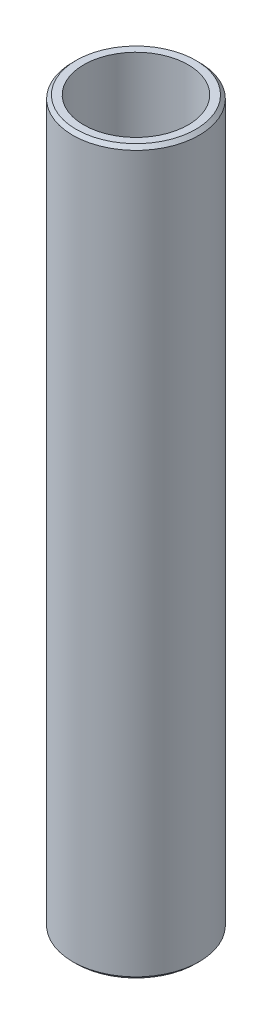
ISO-10303-21;
HEADER;
FILE_DESCRIPTION(('STEP AP214'),'2;1');
FILE_NAME('part.step','',(''),(''),'','','');
FILE_SCHEMA(('AUTOMOTIVE_DESIGN { 1 0 10303 214 1 1 1 1 }'));
ENDSEC;
DATA;
#1=APPLICATION_CONTEXT('core data for automotive mechanical design processes');
#2=APPLICATION_PROTOCOL_DEFINITION('international standard','automotive_design',2000,#1);
#3=PRODUCT_CONTEXT('',#1,'mechanical');
#4=PRODUCT('Part','Part','',(#3));
#5=PRODUCT_RELATED_PRODUCT_CATEGORY('part','',(#4));
#6=PRODUCT_DEFINITION_FORMATION('','',#4);
#7=PRODUCT_DEFINITION_CONTEXT('part definition',#1,'design');
#8=PRODUCT_DEFINITION('design','',#6,#7);
#9=PRODUCT_DEFINITION_SHAPE('','',#8);
#10=(LENGTH_UNIT() NAMED_UNIT(*) SI_UNIT(.MILLI.,.METRE.));
#11=(NAMED_UNIT(*) PLANE_ANGLE_UNIT() SI_UNIT($,.RADIAN.));
#12=(NAMED_UNIT(*) SI_UNIT($,.STERADIAN.) SOLID_ANGLE_UNIT());
#13=UNCERTAINTY_MEASURE_WITH_UNIT(LENGTH_MEASURE(1.E-05),#10,'distance_accuracy_value','');
#14=(GEOMETRIC_REPRESENTATION_CONTEXT(3) GLOBAL_UNCERTAINTY_ASSIGNED_CONTEXT((#13)) GLOBAL_UNIT_ASSIGNED_CONTEXT((#10,
#11,#12)) REPRESENTATION_CONTEXT('',''));
#15=CARTESIAN_POINT('',(0.,0.,0.));
#16=DIRECTION('',(0.,0.,1.));
#17=DIRECTION('',(1.,0.,0.));
#18=AXIS2_PLACEMENT_3D('',#15,#16,#17);
#19=CARTESIAN_POINT('',(0.,600.,0.));
#20=DIRECTION('',(0.,-1.,0.));
#21=DIRECTION('',(0.,0.,-1.));
#22=AXIS2_PLACEMENT_3D('',#19,#20,#21);
#23=CYLINDRICAL_SURFACE('',#22,52.5);
#24=CARTESIAN_POINT('',(0.,597.164512716572,0.));
#25=DIRECTION('',(0.,1.,0.));
#26=DIRECTION('',(0.,0.,1.));
#27=AXIS2_PLACEMENT_3D('',#24,#25,#26);
#28=CIRCLE('',#27,52.5);
#29=CARTESIAN_POINT('',(0.,597.164512716572,52.5));
#30=VERTEX_POINT('',#29);
#31=EDGE_CURVE('E50',#30,#30,#28,.F.);
#32=ORIENTED_EDGE('',*,*,#31,.T.);
#33=EDGE_LOOP('',(#32));
#34=FACE_BOUND('',#33,.T.);
#35=CARTESIAN_POINT('',(0.,2.83548728342797,0.));
#36=DIRECTION('',(0.,1.,0.));
#37=DIRECTION('',(0.,0.,1.));
#38=AXIS2_PLACEMENT_3D('',#35,#36,#37);
#39=CIRCLE('',#38,52.5);
#40=CARTESIAN_POINT('',(0.,2.83548728342797,52.5));
#41=VERTEX_POINT('',#40);
#42=EDGE_CURVE('E51',#41,#41,#39,.T.);
#43=ORIENTED_EDGE('',*,*,#42,.T.);
#44=EDGE_LOOP('',(#43));
#45=FACE_BOUND('',#44,.T.);
#46=ADVANCED_FACE('F39',(#34,#45),#23,.T.);
#47=CARTESIAN_POINT('',(0.,600.,0.));
#48=DIRECTION('',(0.,1.,0.));
#49=DIRECTION('',(0.,0.,1.));
#50=AXIS2_PLACEMENT_3D('',#47,#48,#49);
#51=PLANE('',#50);
#52=CARTESIAN_POINT('',(0.,600.,0.));
#53=DIRECTION('',(0.,1.,0.));
#54=DIRECTION('',(0.,0.,1.));
#55=AXIS2_PLACEMENT_3D('',#52,#53,#54);
#56=CIRCLE('',#55,49.6645127165719);
#57=CARTESIAN_POINT('',(0.,600.,49.6645127165719));
#58=VERTEX_POINT('',#57);
#59=EDGE_CURVE('E54',#58,#58,#56,.T.);
#60=ORIENTED_EDGE('',*,*,#59,.T.);
#61=EDGE_LOOP('',(#60));
#62=FACE_BOUND('',#61,.T.);
#63=CARTESIAN_POINT('',(0.,600.,0.));
#64=DIRECTION('',(0.,1.,0.));
#65=DIRECTION('',(0.,0.,1.));
#66=AXIS2_PLACEMENT_3D('',#63,#64,#65);
#67=CIRCLE('',#66,43.3384236775252);
#68=CARTESIAN_POINT('',(0.,600.,43.3384236775252));
#69=VERTEX_POINT('',#68);
#70=EDGE_CURVE('E58',#69,#69,#67,.T.);
#71=ORIENTED_EDGE('',*,*,#70,.F.);
#72=EDGE_LOOP('',(#71));
#73=FACE_BOUND('',#72,.T.);
#74=ADVANCED_FACE('F69',(#62,#73),#51,.T.);
#75=CARTESIAN_POINT('',(0.,0.,0.));
#76=DIRECTION('',(0.,1.,0.));
#77=DIRECTION('',(0.,0.,1.));
#78=AXIS2_PLACEMENT_3D('',#75,#76,#77);
#79=PLANE('',#78);
#80=CARTESIAN_POINT('',(0.,0.,0.));
#81=DIRECTION('',(0.,1.,0.));
#82=DIRECTION('',(0.,0.,1.));
#83=AXIS2_PLACEMENT_3D('',#80,#81,#82);
#84=CIRCLE('',#83,49.6645127165719);
#85=CARTESIAN_POINT('',(0.,0.,49.6645127165719));
#86=VERTEX_POINT('',#85);
#87=EDGE_CURVE('E10',#86,#86,#84,.F.);
#88=ORIENTED_EDGE('',*,*,#87,.T.);
#89=EDGE_LOOP('',(#88));
#90=FACE_BOUND('',#89,.T.);
#91=CARTESIAN_POINT('',(0.,0.,0.));
#92=DIRECTION('',(0.,1.,0.));
#93=DIRECTION('',(0.,0.,1.));
#94=AXIS2_PLACEMENT_3D('',#91,#92,#93);
#95=CIRCLE('',#94,43.3384236775252);
#96=CARTESIAN_POINT('',(0.,0.,43.3384236775252));
#97=VERTEX_POINT('',#96);
#98=EDGE_CURVE('E63',#97,#97,#95,.T.);
#99=ORIENTED_EDGE('',*,*,#98,.T.);
#100=EDGE_LOOP('',(#99));
#101=FACE_BOUND('',#100,.T.);
#102=ADVANCED_FACE('F75',(#90,#101),#79,.F.);
#103=CARTESIAN_POINT('',(0.,600.,0.));
#104=DIRECTION('',(0.,-1.,0.));
#105=DIRECTION('',(0.,0.,-1.));
#106=AXIS2_PLACEMENT_3D('',#103,#104,#105);
#107=CYLINDRICAL_SURFACE('',#106,43.3384236775252);
#108=ORIENTED_EDGE('',*,*,#70,.T.);
#109=EDGE_LOOP('',(#108));
#110=FACE_BOUND('',#109,.T.);
#111=ORIENTED_EDGE('',*,*,#98,.F.);
#112=EDGE_LOOP('',(#111));
#113=FACE_BOUND('',#112,.T.);
#114=ADVANCED_FACE('F70',(#110,#113),#107,.F.);
#115=CARTESIAN_POINT('',(0.,600.,0.));
#116=DIRECTION('',(0.,-1.,0.));
#117=DIRECTION('',(0.,0.,-1.));
#118=AXIS2_PLACEMENT_3D('',#115,#116,#117);
#119=CONICAL_SURFACE('',#118,49.6645127165719,0.78539816339745);
#120=ORIENTED_EDGE('',*,*,#31,.F.);
#121=EDGE_LOOP('',(#120));
#122=FACE_BOUND('',#121,.T.);
#123=ORIENTED_EDGE('',*,*,#59,.F.);
#124=EDGE_LOOP('',(#123));
#125=FACE_BOUND('',#124,.T.);
#126=ADVANCED_FACE('F81',(#122,#125),#119,.T.);
#127=CARTESIAN_POINT('',(0.,2.83548728342797,0.));
#128=DIRECTION('',(0.,1.,0.));
#129=DIRECTION('',(0.,0.,1.));
#130=AXIS2_PLACEMENT_3D('',#127,#128,#129);
#131=CONICAL_SURFACE('',#130,52.5,0.785398163397469);
#132=ORIENTED_EDGE('',*,*,#87,.F.);
#133=EDGE_LOOP('',(#132));
#134=FACE_BOUND('',#133,.T.);
#135=ORIENTED_EDGE('',*,*,#42,.F.);
#136=EDGE_LOOP('',(#135));
#137=FACE_BOUND('',#136,.T.);
#138=ADVANCED_FACE('F45',(#134,#137),#131,.T.);
#139=CLOSED_SHELL('',(#46,#74,#102,#114,#126,#138));
#140=MANIFOLD_SOLID_BREP('B2',#139);
#141=ADVANCED_BREP_SHAPE_REPRESENTATION('',(#18,#140),#14);
#142=SHAPE_DEFINITION_REPRESENTATION(#9,#141);
ENDSEC;
END-ISO-10303-21;
